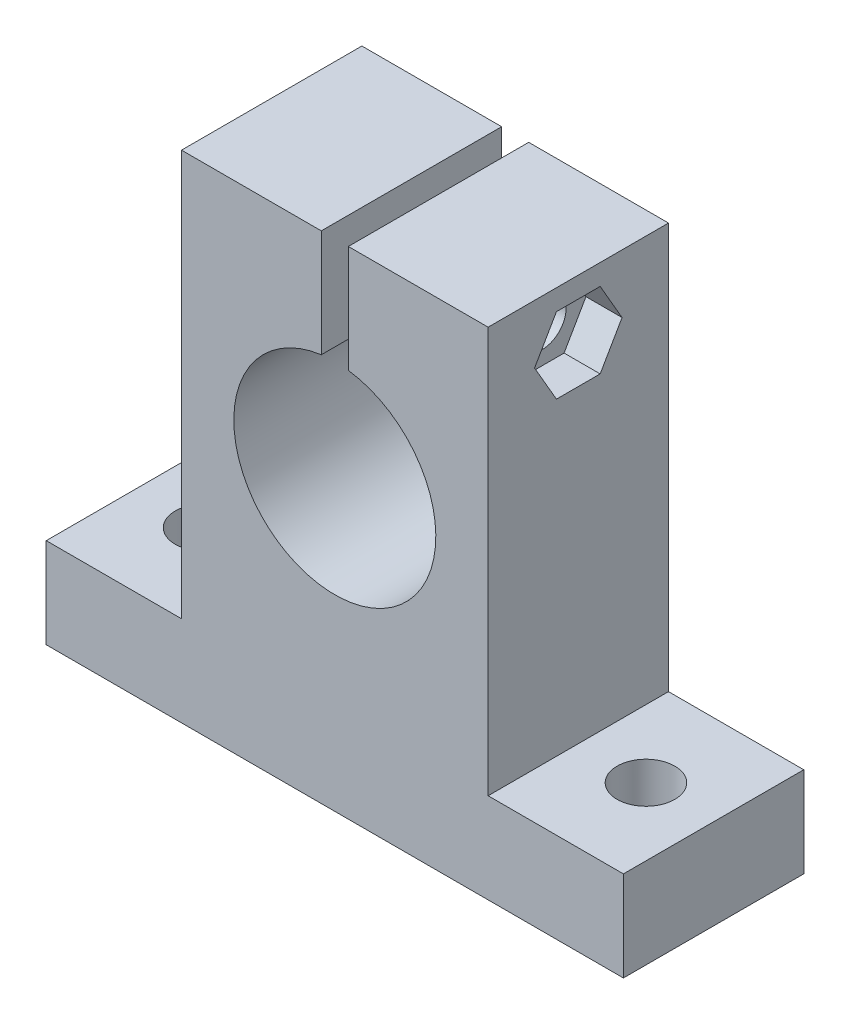
ISO-10303-21;
HEADER;
FILE_DESCRIPTION(('STEP AP214'),'2;1');
FILE_NAME('part.step','',(''),(''),'','','');
FILE_SCHEMA(('AUTOMOTIVE_DESIGN { 1 0 10303 214 1 1 1 1 }'));
ENDSEC;
DATA;
#1=APPLICATION_CONTEXT('core data for automotive mechanical design processes');
#2=APPLICATION_PROTOCOL_DEFINITION('international standard','automotive_design',2000,#1);
#3=PRODUCT_CONTEXT('',#1,'mechanical');
#4=PRODUCT('Part','Part','',(#3));
#5=PRODUCT_RELATED_PRODUCT_CATEGORY('part','',(#4));
#6=PRODUCT_DEFINITION_FORMATION('','',#4);
#7=PRODUCT_DEFINITION_CONTEXT('part definition',#1,'design');
#8=PRODUCT_DEFINITION('design','',#6,#7);
#9=PRODUCT_DEFINITION_SHAPE('','',#8);
#10=(LENGTH_UNIT() NAMED_UNIT(*) SI_UNIT(.MILLI.,.METRE.));
#11=(NAMED_UNIT(*) PLANE_ANGLE_UNIT() SI_UNIT($,.RADIAN.));
#12=(NAMED_UNIT(*) SI_UNIT($,.STERADIAN.) SOLID_ANGLE_UNIT());
#13=UNCERTAINTY_MEASURE_WITH_UNIT(LENGTH_MEASURE(1.E-05),#10,'distance_accuracy_value','');
#14=(GEOMETRIC_REPRESENTATION_CONTEXT(3) GLOBAL_UNCERTAINTY_ASSIGNED_CONTEXT((#13)) GLOBAL_UNIT_ASSIGNED_CONTEXT((#10,
#11,#12)) REPRESENTATION_CONTEXT('',''));
#15=CARTESIAN_POINT('',(0.,0.,0.));
#16=DIRECTION('',(0.,0.,1.));
#17=DIRECTION('',(1.,0.,0.));
#18=AXIS2_PLACEMENT_3D('',#15,#16,#17);
#19=CARTESIAN_POINT('',(-20.,-6.69753086419754,10.));
#20=DIRECTION('',(1.,0.,0.));
#21=DIRECTION('',(0.,0.,-1.));
#22=AXIS2_PLACEMENT_3D('',#19,#20,#21);
#23=CYLINDRICAL_SURFACE('',#22,2.65);
#24=CARTESIAN_POINT('',(1.50000000000001,-6.69753086419754,10.));
#25=DIRECTION('',(1.,0.,0.));
#26=DIRECTION('',(0.,1.,0.));
#27=AXIS2_PLACEMENT_3D('',#24,#25,#26);
#28=CIRCLE('',#27,2.65);
#29=CARTESIAN_POINT('',(1.50000000000001,-4.04753086419754,10.));
#30=VERTEX_POINT('',#29);
#31=EDGE_CURVE('E174',#30,#30,#28,.T.);
#32=ORIENTED_EDGE('',*,*,#31,.F.);
#33=EDGE_LOOP('',(#32));
#34=FACE_BOUND('',#33,.T.);
#35=CARTESIAN_POINT('',(13.,-6.69753086419754,10.));
#36=DIRECTION('',(1.,0.,0.));
#37=DIRECTION('',(0.,0.,-1.));
#38=AXIS2_PLACEMENT_3D('',#35,#36,#37);
#39=CIRCLE('',#38,2.65);
#40=CARTESIAN_POINT('',(13.,-6.69753086419754,7.35));
#41=VERTEX_POINT('',#40);
#42=EDGE_CURVE('E221',#41,#41,#39,.F.);
#43=ORIENTED_EDGE('',*,*,#42,.F.);
#44=EDGE_LOOP('',(#43));
#45=FACE_BOUND('',#44,.T.);
#46=ADVANCED_FACE('F35',(#34,#45),#23,.F.);
#47=CARTESIAN_POINT('',(17.,-0.197530864197544,20.));
#48=DIRECTION('',(-1.,0.,0.));
#49=DIRECTION('',(0.,-1.,0.));
#50=AXIS2_PLACEMENT_3D('',#47,#48,#49);
#51=PLANE('',#50);
#52=DIRECTION('',(0.,0.866025403784438,0.5));
#53=VECTOR('',#52,1.);
#54=CARTESIAN_POINT('',(17.,-6.69753086419754,5.15075642137325));
#55=LINE('',#54,#53);
#56=CARTESIAN_POINT('',(17.,-6.69753086419754,5.15075642137325));
#57=VERTEX_POINT('',#56);
#58=CARTESIAN_POINT('',(17.,-2.4979627359682,7.57537821068663));
#59=VERTEX_POINT('',#58);
#60=EDGE_CURVE('E513',#57,#59,#55,.T.);
#61=ORIENTED_EDGE('',*,*,#60,.F.);
#62=DIRECTION('',(0.,0.866025403784439,-0.499999999999999));
#63=VECTOR('',#62,1.);
#64=CARTESIAN_POINT('',(17.,-10.8970989924269,7.57537821068662));
#65=LINE('',#64,#63);
#66=CARTESIAN_POINT('',(17.,-10.8970989924269,7.57537821068662));
#67=VERTEX_POINT('',#66);
#68=EDGE_CURVE('E52',#67,#57,#65,.T.);
#69=ORIENTED_EDGE('',*,*,#68,.F.);
#70=DIRECTION('',(0.,0.,-1.));
#71=VECTOR('',#70,1.);
#72=CARTESIAN_POINT('',(17.,-10.8970989924269,12.4246217893134));
#73=LINE('',#72,#71);
#74=CARTESIAN_POINT('',(17.,-10.8970989924269,12.4246217893134));
#75=VERTEX_POINT('',#74);
#76=EDGE_CURVE('E235',#75,#67,#73,.T.);
#77=ORIENTED_EDGE('',*,*,#76,.F.);
#78=DIRECTION('',(0.,-0.866025403784438,-0.5));
#79=VECTOR('',#78,1.);
#80=CARTESIAN_POINT('',(17.,-6.69753086419754,14.8492435786268));
#81=LINE('',#80,#79);
#82=CARTESIAN_POINT('',(17.,-6.69753086419754,14.8492435786268));
#83=VERTEX_POINT('',#82);
#84=EDGE_CURVE('E544',#83,#75,#81,.T.);
#85=ORIENTED_EDGE('',*,*,#84,.F.);
#86=DIRECTION('',(0.,-0.866025403784439,0.499999999999999));
#87=VECTOR('',#86,1.);
#88=CARTESIAN_POINT('',(17.,-2.4979627359682,12.4246217893134));
#89=LINE('',#88,#87);
#90=CARTESIAN_POINT('',(17.,-2.4979627359682,12.4246217893134));
#91=VERTEX_POINT('',#90);
#92=EDGE_CURVE('E542',#91,#83,#89,.T.);
#93=ORIENTED_EDGE('',*,*,#92,.F.);
#94=DIRECTION('',(0.,0.,1.));
#95=VECTOR('',#94,1.);
#96=CARTESIAN_POINT('',(17.,-2.4979627359682,7.57537821068663));
#97=LINE('',#96,#95);
#98=EDGE_CURVE('E539',#59,#91,#97,.T.);
#99=ORIENTED_EDGE('',*,*,#98,.F.);
#100=EDGE_LOOP('',(#61,#69,#77,#85,#93,#99));
#101=FACE_BOUND('',#100,.T.);
#102=DIRECTION('',(0.,1.,0.));
#103=VECTOR('',#102,1.);
#104=CARTESIAN_POINT('',(17.,-0.197530864197544,0.));
#105=LINE('',#104,#103);
#106=CARTESIAN_POINT('',(17.,-45.1975308641975,0.));
#107=VERTEX_POINT('',#106);
#108=CARTESIAN_POINT('',(17.,-0.197530864197544,0.));
#109=VERTEX_POINT('',#108);
#110=EDGE_CURVE('E170',#107,#109,#105,.T.);
#111=ORIENTED_EDGE('',*,*,#110,.T.);
#112=DIRECTION('',(0.,0.,-1.));
#113=VECTOR('',#112,1.);
#114=CARTESIAN_POINT('',(17.,-0.197530864197544,20.));
#115=LINE('',#114,#113);
#116=CARTESIAN_POINT('',(17.,-0.197530864197544,20.));
#117=VERTEX_POINT('',#116);
#118=EDGE_CURVE('E11',#117,#109,#115,.T.);
#119=ORIENTED_EDGE('',*,*,#118,.F.);
#120=DIRECTION('',(0.,1.,0.));
#121=VECTOR('',#120,1.);
#122=CARTESIAN_POINT('',(17.,-0.197530864197544,20.));
#123=LINE('',#122,#121);
#124=CARTESIAN_POINT('',(17.,-45.1975308641975,20.));
#125=VERTEX_POINT('',#124);
#126=EDGE_CURVE('E194',#125,#117,#123,.T.);
#127=ORIENTED_EDGE('',*,*,#126,.F.);
#128=DIRECTION('',(0.,0.,-1.));
#129=VECTOR('',#128,1.);
#130=CARTESIAN_POINT('',(17.,-45.1975308641975,20.));
#131=LINE('',#130,#129);
#132=EDGE_CURVE('E166',#125,#107,#131,.T.);
#133=ORIENTED_EDGE('',*,*,#132,.T.);
#134=EDGE_LOOP('',(#111,#119,#127,#133));
#135=FACE_BOUND('',#134,.T.);
#136=ADVANCED_FACE('F37',(#101,#135),#51,.F.);
#137=CARTESIAN_POINT('',(17.,-0.197530864197544,20.));
#138=DIRECTION('',(0.,-1.,0.));
#139=DIRECTION('',(1.,0.,0.));
#140=AXIS2_PLACEMENT_3D('',#137,#138,#139);
#141=PLANE('',#140);
#142=DIRECTION('',(-1.,0.,0.));
#143=VECTOR('',#142,1.);
#144=CARTESIAN_POINT('',(17.,-0.197530864197544,0.));
#145=LINE('',#144,#143);
#146=CARTESIAN_POINT('',(1.50000000000001,-0.19753086419755,0.));
#147=VERTEX_POINT('',#146);
#148=EDGE_CURVE('E173',#109,#147,#145,.T.);
#149=ORIENTED_EDGE('',*,*,#148,.T.);
#150=DIRECTION('',(0.,0.,-1.));
#151=VECTOR('',#150,1.);
#152=CARTESIAN_POINT('',(1.50000000000001,-0.19753086419755,20.));
#153=LINE('',#152,#151);
#154=CARTESIAN_POINT('',(1.50000000000001,-0.19753086419755,20.));
#155=VERTEX_POINT('',#154);
#156=EDGE_CURVE('E44',#155,#147,#153,.T.);
#157=ORIENTED_EDGE('',*,*,#156,.F.);
#158=DIRECTION('',(-1.,0.,0.));
#159=VECTOR('',#158,1.);
#160=CARTESIAN_POINT('',(17.,-0.197530864197544,20.));
#161=LINE('',#160,#159);
#162=EDGE_CURVE('E114',#117,#155,#161,.T.);
#163=ORIENTED_EDGE('',*,*,#162,.F.);
#164=ORIENTED_EDGE('',*,*,#118,.T.);
#165=EDGE_LOOP('',(#149,#157,#163,#164));
#166=FACE_BOUND('',#165,.T.);
#167=ADVANCED_FACE('F285',(#166),#141,.F.);
#168=CARTESIAN_POINT('',(1.50000000000001,-0.19753086419755,20.));
#169=DIRECTION('',(1.,0.,0.));
#170=DIRECTION('',(0.,1.,0.));
#171=AXIS2_PLACEMENT_3D('',#168,#169,#170);
#172=PLANE('',#171);
#173=ORIENTED_EDGE('',*,*,#31,.T.);
#174=EDGE_LOOP('',(#173));
#175=FACE_BOUND('',#174,.T.);
#176=DIRECTION('',(0.,-1.,0.));
#177=VECTOR('',#176,1.);
#178=CARTESIAN_POINT('',(1.50000000000001,-0.19753086419755,0.));
#179=LINE('',#178,#177);
#180=CARTESIAN_POINT('',(1.50000000000001,-12.098431801661,0.));
#181=VERTEX_POINT('',#180);
#182=EDGE_CURVE('E176',#147,#181,#179,.T.);
#183=ORIENTED_EDGE('',*,*,#182,.T.);
#184=DIRECTION('',(0.,0.,-1.));
#185=VECTOR('',#184,1.);
#186=CARTESIAN_POINT('',(1.50000000000001,-12.098431801661,20.));
#187=LINE('',#186,#185);
#188=CARTESIAN_POINT('',(1.50000000000001,-12.098431801661,20.));
#189=VERTEX_POINT('',#188);
#190=EDGE_CURVE('E213',#189,#181,#187,.T.);
#191=ORIENTED_EDGE('',*,*,#190,.F.);
#192=DIRECTION('',(0.,-1.,0.));
#193=VECTOR('',#192,1.);
#194=CARTESIAN_POINT('',(1.50000000000001,-0.19753086419755,20.));
#195=LINE('',#194,#193);
#196=EDGE_CURVE('E255',#155,#189,#195,.T.);
#197=ORIENTED_EDGE('',*,*,#196,.F.);
#198=ORIENTED_EDGE('',*,*,#156,.T.);
#199=EDGE_LOOP('',(#183,#191,#197,#198));
#200=FACE_BOUND('',#199,.T.);
#201=ADVANCED_FACE('F288',(#175,#200),#172,.F.);
#202=CARTESIAN_POINT('',(0.,-23.1975308641975,20.));
#203=DIRECTION('',(0.,0.,-1.));
#204=DIRECTION('',(-1.,0.,0.));
#205=AXIS2_PLACEMENT_3D('',#202,#203,#204);
#206=CYLINDRICAL_SURFACE('',#205,11.2);
#207=CARTESIAN_POINT('',(0.,-23.1975308641975,0.));
#208=DIRECTION('',(0.,0.,-1.));
#209=DIRECTION('',(1.,0.,0.));
#210=AXIS2_PLACEMENT_3D('',#207,#208,#209);
#211=CIRCLE('',#210,11.2);
#212=CARTESIAN_POINT('',(-1.49999999999999,-12.098431801661,0.));
#213=VERTEX_POINT('',#212);
#214=EDGE_CURVE('E178',#181,#213,#211,.T.);
#215=ORIENTED_EDGE('',*,*,#214,.T.);
#216=DIRECTION('',(0.,0.,-1.));
#217=VECTOR('',#216,1.);
#218=CARTESIAN_POINT('',(-1.49999999999999,-12.098431801661,20.));
#219=LINE('',#218,#217);
#220=CARTESIAN_POINT('',(-1.49999999999999,-12.098431801661,20.));
#221=VERTEX_POINT('',#220);
#222=EDGE_CURVE('E210',#221,#213,#219,.T.);
#223=ORIENTED_EDGE('',*,*,#222,.F.);
#224=CARTESIAN_POINT('',(0.,-23.1975308641975,20.));
#225=DIRECTION('',(0.,0.,-1.));
#226=DIRECTION('',(1.,0.,0.));
#227=AXIS2_PLACEMENT_3D('',#224,#225,#226);
#228=CIRCLE('',#227,11.2);
#229=EDGE_CURVE('E257',#189,#221,#228,.T.);
#230=ORIENTED_EDGE('',*,*,#229,.F.);
#231=ORIENTED_EDGE('',*,*,#190,.T.);
#232=EDGE_LOOP('',(#215,#223,#230,#231));
#233=FACE_BOUND('',#232,.T.);
#234=ADVANCED_FACE('F293',(#233),#206,.F.);
#235=CARTESIAN_POINT('',(-1.49999999999999,-0.19753086419755,20.));
#236=DIRECTION('',(-1.,0.,0.));
#237=DIRECTION('',(0.,-1.,0.));
#238=AXIS2_PLACEMENT_3D('',#235,#236,#237);
#239=PLANE('',#238);
#240=CARTESIAN_POINT('',(-1.49999999999999,-6.69753086419754,10.));
#241=DIRECTION('',(-1.,0.,0.));
#242=DIRECTION('',(0.,-1.,0.));
#243=AXIS2_PLACEMENT_3D('',#240,#241,#242);
#244=CIRCLE('',#243,2.65);
#245=CARTESIAN_POINT('',(-1.49999999999999,-9.34753086419754,10.));
#246=VERTEX_POINT('',#245);
#247=EDGE_CURVE('E220',#246,#246,#244,.T.);
#248=ORIENTED_EDGE('',*,*,#247,.T.);
#249=EDGE_LOOP('',(#248));
#250=FACE_BOUND('',#249,.T.);
#251=DIRECTION('',(0.,1.,0.));
#252=VECTOR('',#251,1.);
#253=CARTESIAN_POINT('',(-1.49999999999999,-0.19753086419755,0.));
#254=LINE('',#253,#252);
#255=CARTESIAN_POINT('',(-1.49999999999999,-0.19753086419755,0.));
#256=VERTEX_POINT('',#255);
#257=EDGE_CURVE('E180',#213,#256,#254,.T.);
#258=ORIENTED_EDGE('',*,*,#257,.T.);
#259=DIRECTION('',(0.,0.,-1.));
#260=VECTOR('',#259,1.);
#261=CARTESIAN_POINT('',(-1.49999999999999,-0.19753086419755,20.));
#262=LINE('',#261,#260);
#263=CARTESIAN_POINT('',(-1.49999999999999,-0.19753086419755,20.));
#264=VERTEX_POINT('',#263);
#265=EDGE_CURVE('E207',#264,#256,#262,.T.);
#266=ORIENTED_EDGE('',*,*,#265,.F.);
#267=DIRECTION('',(0.,1.,0.));
#268=VECTOR('',#267,1.);
#269=CARTESIAN_POINT('',(-1.49999999999999,-0.19753086419755,20.));
#270=LINE('',#269,#268);
#271=EDGE_CURVE('E259',#221,#264,#270,.T.);
#272=ORIENTED_EDGE('',*,*,#271,.F.);
#273=ORIENTED_EDGE('',*,*,#222,.T.);
#274=EDGE_LOOP('',(#258,#266,#272,#273));
#275=FACE_BOUND('',#274,.T.);
#276=ADVANCED_FACE('F299',(#250,#275),#239,.F.);
#277=CARTESIAN_POINT('',(-1.49999999999999,-0.19753086419755,20.));
#278=DIRECTION('',(0.,-1.,0.));
#279=DIRECTION('',(1.,0.,0.));
#280=AXIS2_PLACEMENT_3D('',#277,#278,#279);
#281=PLANE('',#280);
#282=DIRECTION('',(-1.,0.,0.));
#283=VECTOR('',#282,1.);
#284=CARTESIAN_POINT('',(-1.49999999999999,-0.19753086419755,0.));
#285=LINE('',#284,#283);
#286=CARTESIAN_POINT('',(-17.,-0.197530864197548,0.));
#287=VERTEX_POINT('',#286);
#288=EDGE_CURVE('E182',#256,#287,#285,.T.);
#289=ORIENTED_EDGE('',*,*,#288,.T.);
#290=DIRECTION('',(0.,0.,-1.));
#291=VECTOR('',#290,1.);
#292=CARTESIAN_POINT('',(-17.,-0.197530864197548,20.));
#293=LINE('',#292,#291);
#294=CARTESIAN_POINT('',(-17.,-0.197530864197548,20.));
#295=VERTEX_POINT('',#294);
#296=EDGE_CURVE('E204',#295,#287,#293,.T.);
#297=ORIENTED_EDGE('',*,*,#296,.F.);
#298=DIRECTION('',(-1.,0.,0.));
#299=VECTOR('',#298,1.);
#300=CARTESIAN_POINT('',(-1.49999999999999,-0.19753086419755,20.));
#301=LINE('',#300,#299);
#302=EDGE_CURVE('E261',#264,#295,#301,.T.);
#303=ORIENTED_EDGE('',*,*,#302,.F.);
#304=ORIENTED_EDGE('',*,*,#265,.T.);
#305=EDGE_LOOP('',(#289,#297,#303,#304));
#306=FACE_BOUND('',#305,.T.);
#307=ADVANCED_FACE('F303',(#306),#281,.F.);
#308=CARTESIAN_POINT('',(-17.,-0.197530864197548,20.));
#309=DIRECTION('',(1.,0.,0.));
#310=DIRECTION('',(0.,1.,0.));
#311=AXIS2_PLACEMENT_3D('',#308,#309,#310);
#312=PLANE('',#311);
#313=CARTESIAN_POINT('',(-17.,-6.69753086419754,10.));
#314=DIRECTION('',(1.,0.,0.));
#315=DIRECTION('',(0.,1.,0.));
#316=AXIS2_PLACEMENT_3D('',#313,#314,#315);
#317=CIRCLE('',#316,2.65);
#318=CARTESIAN_POINT('',(-17.,-4.04753086419754,10.));
#319=VERTEX_POINT('',#318);
#320=EDGE_CURVE('E218',#319,#319,#317,.T.);
#321=ORIENTED_EDGE('',*,*,#320,.T.);
#322=EDGE_LOOP('',(#321));
#323=FACE_BOUND('',#322,.T.);
#324=DIRECTION('',(0.,-1.,0.));
#325=VECTOR('',#324,1.);
#326=CARTESIAN_POINT('',(-17.,-0.197530864197548,0.));
#327=LINE('',#326,#325);
#328=CARTESIAN_POINT('',(-17.,-45.1975308641975,0.));
#329=VERTEX_POINT('',#328);
#330=EDGE_CURVE('E184',#287,#329,#327,.T.);
#331=ORIENTED_EDGE('',*,*,#330,.T.);
#332=DIRECTION('',(0.,0.,-1.));
#333=VECTOR('',#332,1.);
#334=CARTESIAN_POINT('',(-17.,-45.1975308641975,20.));
#335=LINE('',#334,#333);
#336=CARTESIAN_POINT('',(-17.,-45.1975308641975,20.));
#337=VERTEX_POINT('',#336);
#338=EDGE_CURVE('E201',#337,#329,#335,.T.);
#339=ORIENTED_EDGE('',*,*,#338,.F.);
#340=DIRECTION('',(0.,-1.,0.));
#341=VECTOR('',#340,1.);
#342=CARTESIAN_POINT('',(-17.,-0.197530864197548,20.));
#343=LINE('',#342,#341);
#344=EDGE_CURVE('E263',#295,#337,#343,.T.);
#345=ORIENTED_EDGE('',*,*,#344,.F.);
#346=ORIENTED_EDGE('',*,*,#296,.T.);
#347=EDGE_LOOP('',(#331,#339,#345,#346));
#348=FACE_BOUND('',#347,.T.);
#349=ADVANCED_FACE('F306',(#323,#348),#312,.F.);
#350=CARTESIAN_POINT('',(-32.,-45.1975308641975,20.));
#351=DIRECTION('',(0.,-1.,0.));
#352=DIRECTION('',(0.,0.,-1.));
#353=AXIS2_PLACEMENT_3D('',#350,#351,#352);
#354=PLANE('',#353);
#355=CARTESIAN_POINT('',(-24.5,-45.1975308641975,10.));
#356=DIRECTION('',(0.,-1.,0.));
#357=DIRECTION('',(0.,0.,-1.));
#358=AXIS2_PLACEMENT_3D('',#355,#356,#357);
#359=CIRCLE('',#358,3.2);
#360=CARTESIAN_POINT('',(-24.5,-45.1975308641975,6.8));
#361=VERTEX_POINT('',#360);
#362=EDGE_CURVE('E511',#361,#361,#359,.T.);
#363=ORIENTED_EDGE('',*,*,#362,.T.);
#364=EDGE_LOOP('',(#363));
#365=FACE_BOUND('',#364,.T.);
#366=DIRECTION('',(-1.,0.,0.));
#367=VECTOR('',#366,1.);
#368=CARTESIAN_POINT('',(-32.,-45.1975308641975,0.));
#369=LINE('',#368,#367);
#370=CARTESIAN_POINT('',(-32.,-45.1975308641975,0.));
#371=VERTEX_POINT('',#370);
#372=EDGE_CURVE('E186',#329,#371,#369,.T.);
#373=ORIENTED_EDGE('',*,*,#372,.T.);
#374=DIRECTION('',(0.,0.,-1.));
#375=VECTOR('',#374,1.);
#376=CARTESIAN_POINT('',(-32.,-45.1975308641975,20.));
#377=LINE('',#376,#375);
#378=CARTESIAN_POINT('',(-32.,-45.1975308641975,20.));
#379=VERTEX_POINT('',#378);
#380=EDGE_CURVE('E198',#379,#371,#377,.T.);
#381=ORIENTED_EDGE('',*,*,#380,.F.);
#382=DIRECTION('',(-1.,0.,0.));
#383=VECTOR('',#382,1.);
#384=CARTESIAN_POINT('',(-32.,-45.1975308641975,20.));
#385=LINE('',#384,#383);
#386=EDGE_CURVE('E265',#337,#379,#385,.T.);
#387=ORIENTED_EDGE('',*,*,#386,.F.);
#388=ORIENTED_EDGE('',*,*,#338,.T.);
#389=EDGE_LOOP('',(#373,#381,#387,#388));
#390=FACE_BOUND('',#389,.T.);
#391=ADVANCED_FACE('F271',(#365,#390),#354,.F.);
#392=CARTESIAN_POINT('',(-32.,-55.1975308641975,20.));
#393=DIRECTION('',(1.,0.,0.));
#394=DIRECTION('',(0.,0.,-1.));
#395=AXIS2_PLACEMENT_3D('',#392,#393,#394);
#396=PLANE('',#395);
#397=DIRECTION('',(0.,-1.,0.));
#398=VECTOR('',#397,1.);
#399=CARTESIAN_POINT('',(-32.,-55.1975308641975,0.));
#400=LINE('',#399,#398);
#401=CARTESIAN_POINT('',(-32.,-55.1975308641975,0.));
#402=VERTEX_POINT('',#401);
#403=EDGE_CURVE('E188',#371,#402,#400,.T.);
#404=ORIENTED_EDGE('',*,*,#403,.T.);
#405=DIRECTION('',(0.,0.,-1.));
#406=VECTOR('',#405,1.);
#407=CARTESIAN_POINT('',(-32.,-55.1975308641975,20.));
#408=LINE('',#407,#406);
#409=CARTESIAN_POINT('',(-32.,-55.1975308641975,20.));
#410=VERTEX_POINT('',#409);
#411=EDGE_CURVE('E161',#410,#402,#408,.T.);
#412=ORIENTED_EDGE('',*,*,#411,.F.);
#413=DIRECTION('',(0.,-1.,0.));
#414=VECTOR('',#413,1.);
#415=CARTESIAN_POINT('',(-32.,-55.1975308641975,20.));
#416=LINE('',#415,#414);
#417=EDGE_CURVE('E149',#379,#410,#416,.T.);
#418=ORIENTED_EDGE('',*,*,#417,.F.);
#419=ORIENTED_EDGE('',*,*,#380,.T.);
#420=EDGE_LOOP('',(#404,#412,#418,#419));
#421=FACE_BOUND('',#420,.T.);
#422=ADVANCED_FACE('F275',(#421),#396,.F.);
#423=CARTESIAN_POINT('',(-32.,-55.1975308641975,20.));
#424=DIRECTION('',(0.,1.,0.));
#425=DIRECTION('',(-1.,0.,0.));
#426=AXIS2_PLACEMENT_3D('',#423,#424,#425);
#427=PLANE('',#426);
#428=CARTESIAN_POINT('',(-24.5,-55.1975308641975,10.));
#429=DIRECTION('',(0.,-1.,0.));
#430=DIRECTION('',(1.,0.,0.));
#431=AXIS2_PLACEMENT_3D('',#428,#429,#430);
#432=CIRCLE('',#431,3.2);
#433=CARTESIAN_POINT('',(-21.3,-55.1975308641975,10.));
#434=VERTEX_POINT('',#433);
#435=EDGE_CURVE('E508',#434,#434,#432,.T.);
#436=ORIENTED_EDGE('',*,*,#435,.F.);
#437=EDGE_LOOP('',(#436));
#438=FACE_BOUND('',#437,.T.);
#439=CARTESIAN_POINT('',(24.5,-55.1975308641975,10.));
#440=DIRECTION('',(0.,-1.,0.));
#441=DIRECTION('',(-1.,0.,0.));
#442=AXIS2_PLACEMENT_3D('',#439,#440,#441);
#443=CIRCLE('',#442,3.2);
#444=CARTESIAN_POINT('',(21.3,-55.1975308641975,10.));
#445=VERTEX_POINT('',#444);
#446=EDGE_CURVE('E518',#445,#445,#443,.T.);
#447=ORIENTED_EDGE('',*,*,#446,.F.);
#448=EDGE_LOOP('',(#447));
#449=FACE_BOUND('',#448,.T.);
#450=DIRECTION('',(1.,0.,0.));
#451=VECTOR('',#450,1.);
#452=CARTESIAN_POINT('',(-32.,-55.1975308641975,0.));
#453=LINE('',#452,#451);
#454=CARTESIAN_POINT('',(32.,-55.1975308641975,0.));
#455=VERTEX_POINT('',#454);
#456=EDGE_CURVE('E158',#402,#455,#453,.T.);
#457=ORIENTED_EDGE('',*,*,#456,.T.);
#458=DIRECTION('',(0.,0.,-1.));
#459=VECTOR('',#458,1.);
#460=CARTESIAN_POINT('',(32.,-55.1975308641975,20.));
#461=LINE('',#460,#459);
#462=CARTESIAN_POINT('',(32.,-55.1975308641975,20.));
#463=VERTEX_POINT('',#462);
#464=EDGE_CURVE('E155',#463,#455,#461,.T.);
#465=ORIENTED_EDGE('',*,*,#464,.F.);
#466=DIRECTION('',(1.,0.,0.));
#467=VECTOR('',#466,1.);
#468=CARTESIAN_POINT('',(-32.,-55.1975308641975,20.));
#469=LINE('',#468,#467);
#470=EDGE_CURVE('E142',#410,#463,#469,.T.);
#471=ORIENTED_EDGE('',*,*,#470,.F.);
#472=ORIENTED_EDGE('',*,*,#411,.T.);
#473=EDGE_LOOP('',(#457,#465,#471,#472));
#474=FACE_BOUND('',#473,.T.);
#475=ADVANCED_FACE('F156',(#438,#449,#474),#427,.F.);
#476=CARTESIAN_POINT('',(32.,-55.1975308641975,20.));
#477=DIRECTION('',(-1.,0.,0.));
#478=DIRECTION('',(0.,0.,1.));
#479=AXIS2_PLACEMENT_3D('',#476,#477,#478);
#480=PLANE('',#479);
#481=DIRECTION('',(0.,1.,0.));
#482=VECTOR('',#481,1.);
#483=CARTESIAN_POINT('',(32.,-55.1975308641975,0.));
#484=LINE('',#483,#482);
#485=CARTESIAN_POINT('',(32.,-45.1975308641975,0.));
#486=VERTEX_POINT('',#485);
#487=EDGE_CURVE('E191',#455,#486,#484,.T.);
#488=ORIENTED_EDGE('',*,*,#487,.T.);
#489=DIRECTION('',(0.,0.,-1.));
#490=VECTOR('',#489,1.);
#491=CARTESIAN_POINT('',(32.,-45.1975308641975,20.));
#492=LINE('',#491,#490);
#493=CARTESIAN_POINT('',(32.,-45.1975308641975,20.));
#494=VERTEX_POINT('',#493);
#495=EDGE_CURVE('E162',#494,#486,#492,.T.);
#496=ORIENTED_EDGE('',*,*,#495,.F.);
#497=DIRECTION('',(0.,1.,0.));
#498=VECTOR('',#497,1.);
#499=CARTESIAN_POINT('',(32.,-55.1975308641975,20.));
#500=LINE('',#499,#498);
#501=EDGE_CURVE('E146',#463,#494,#500,.T.);
#502=ORIENTED_EDGE('',*,*,#501,.F.);
#503=ORIENTED_EDGE('',*,*,#464,.T.);
#504=EDGE_LOOP('',(#488,#496,#502,#503));
#505=FACE_BOUND('',#504,.T.);
#506=ADVANCED_FACE('F164',(#505),#480,.F.);
#507=CARTESIAN_POINT('',(17.,-45.1975308641975,20.));
#508=DIRECTION('',(0.,-1.,0.));
#509=DIRECTION('',(0.,0.,-1.));
#510=AXIS2_PLACEMENT_3D('',#507,#508,#509);
#511=PLANE('',#510);
#512=CARTESIAN_POINT('',(24.5,-45.1975308641975,10.));
#513=DIRECTION('',(0.,-1.,0.));
#514=DIRECTION('',(0.,0.,-1.));
#515=AXIS2_PLACEMENT_3D('',#512,#513,#514);
#516=CIRCLE('',#515,3.2);
#517=CARTESIAN_POINT('',(24.5,-45.1975308641975,6.8));
#518=VERTEX_POINT('',#517);
#519=EDGE_CURVE('E39',#518,#518,#516,.T.);
#520=ORIENTED_EDGE('',*,*,#519,.T.);
#521=EDGE_LOOP('',(#520));
#522=FACE_BOUND('',#521,.T.);
#523=DIRECTION('',(-1.,0.,0.));
#524=VECTOR('',#523,1.);
#525=CARTESIAN_POINT('',(17.,-45.1975308641975,0.));
#526=LINE('',#525,#524);
#527=EDGE_CURVE('E106',#486,#107,#526,.T.);
#528=ORIENTED_EDGE('',*,*,#527,.T.);
#529=ORIENTED_EDGE('',*,*,#132,.F.);
#530=DIRECTION('',(-1.,0.,0.));
#531=VECTOR('',#530,1.);
#532=CARTESIAN_POINT('',(17.,-45.1975308641975,20.));
#533=LINE('',#532,#531);
#534=EDGE_CURVE('E61',#494,#125,#533,.T.);
#535=ORIENTED_EDGE('',*,*,#534,.F.);
#536=ORIENTED_EDGE('',*,*,#495,.T.);
#537=EDGE_LOOP('',(#528,#529,#535,#536));
#538=FACE_BOUND('',#537,.T.);
#539=ADVANCED_FACE('F279',(#522,#538),#511,.F.);
#540=CARTESIAN_POINT('',(0.,-23.1975308641975,20.));
#541=DIRECTION('',(0.,0.,1.));
#542=DIRECTION('',(1.,0.,0.));
#543=AXIS2_PLACEMENT_3D('',#540,#541,#542);
#544=PLANE('',#543);
#545=ORIENTED_EDGE('',*,*,#126,.T.);
#546=ORIENTED_EDGE('',*,*,#162,.T.);
#547=ORIENTED_EDGE('',*,*,#196,.T.);
#548=ORIENTED_EDGE('',*,*,#229,.T.);
#549=ORIENTED_EDGE('',*,*,#271,.T.);
#550=ORIENTED_EDGE('',*,*,#302,.T.);
#551=ORIENTED_EDGE('',*,*,#344,.T.);
#552=ORIENTED_EDGE('',*,*,#386,.T.);
#553=ORIENTED_EDGE('',*,*,#417,.T.);
#554=ORIENTED_EDGE('',*,*,#470,.T.);
#555=ORIENTED_EDGE('',*,*,#501,.T.);
#556=ORIENTED_EDGE('',*,*,#534,.T.);
#557=EDGE_LOOP('',(#545,#546,#547,#548,#549,#550,#551,#552,#553,#554,#555,#556));
#558=FACE_BOUND('',#557,.T.);
#559=ADVANCED_FACE('F144',(#558),#544,.T.);
#560=CARTESIAN_POINT('',(0.,-23.1975308641975,0.));
#561=DIRECTION('',(0.,0.,1.));
#562=DIRECTION('',(1.,0.,0.));
#563=AXIS2_PLACEMENT_3D('',#560,#561,#562);
#564=PLANE('',#563);
#565=ORIENTED_EDGE('',*,*,#110,.F.);
#566=ORIENTED_EDGE('',*,*,#527,.F.);
#567=ORIENTED_EDGE('',*,*,#487,.F.);
#568=ORIENTED_EDGE('',*,*,#456,.F.);
#569=ORIENTED_EDGE('',*,*,#403,.F.);
#570=ORIENTED_EDGE('',*,*,#372,.F.);
#571=ORIENTED_EDGE('',*,*,#330,.F.);
#572=ORIENTED_EDGE('',*,*,#288,.F.);
#573=ORIENTED_EDGE('',*,*,#257,.F.);
#574=ORIENTED_EDGE('',*,*,#214,.F.);
#575=ORIENTED_EDGE('',*,*,#182,.F.);
#576=ORIENTED_EDGE('',*,*,#148,.F.);
#577=EDGE_LOOP('',(#565,#566,#567,#568,#569,#570,#571,#572,#573,#574,#575,#576));
#578=FACE_BOUND('',#577,.T.);
#579=ADVANCED_FACE('F278',(#578),#564,.F.);
#580=ORIENTED_EDGE('',*,*,#320,.F.);
#581=EDGE_LOOP('',(#580));
#582=FACE_BOUND('',#581,.T.);
#583=ORIENTED_EDGE('',*,*,#247,.F.);
#584=EDGE_LOOP('',(#583));
#585=FACE_BOUND('',#584,.T.);
#586=ADVANCED_FACE('F320',(#582,#585),#23,.F.);
#587=CARTESIAN_POINT('',(13.,0.,0.));
#588=DIRECTION('',(1.,0.,0.));
#589=DIRECTION('',(0.,0.,-1.));
#590=AXIS2_PLACEMENT_3D('',#587,#588,#589);
#591=PLANE('',#590);
#592=DIRECTION('',(0.,0.866025403784439,-0.499999999999999));
#593=VECTOR('',#592,1.);
#594=CARTESIAN_POINT('',(13.,-10.8970989924269,7.57537821068662));
#595=LINE('',#594,#593);
#596=CARTESIAN_POINT('',(13.,-10.8970989924269,7.57537821068662));
#597=VERTEX_POINT('',#596);
#598=CARTESIAN_POINT('',(13.,-6.69753086419754,5.15075642137325));
#599=VERTEX_POINT('',#598);
#600=EDGE_CURVE('E520',#597,#599,#595,.T.);
#601=ORIENTED_EDGE('',*,*,#600,.T.);
#602=DIRECTION('',(0.,0.866025403784438,0.5));
#603=VECTOR('',#602,1.);
#604=CARTESIAN_POINT('',(13.,-6.69753086419754,5.15075642137325));
#605=LINE('',#604,#603);
#606=CARTESIAN_POINT('',(13.,-2.4979627359682,7.57537821068663));
#607=VERTEX_POINT('',#606);
#608=EDGE_CURVE('E523',#599,#607,#605,.T.);
#609=ORIENTED_EDGE('',*,*,#608,.T.);
#610=DIRECTION('',(0.,0.,1.));
#611=VECTOR('',#610,1.);
#612=CARTESIAN_POINT('',(13.,-2.4979627359682,7.57537821068663));
#613=LINE('',#612,#611);
#614=CARTESIAN_POINT('',(13.,-2.4979627359682,12.4246217893134));
#615=VERTEX_POINT('',#614);
#616=EDGE_CURVE('E526',#607,#615,#613,.T.);
#617=ORIENTED_EDGE('',*,*,#616,.T.);
#618=DIRECTION('',(0.,-0.866025403784439,0.499999999999999));
#619=VECTOR('',#618,1.);
#620=CARTESIAN_POINT('',(13.,-2.4979627359682,12.4246217893134));
#621=LINE('',#620,#619);
#622=CARTESIAN_POINT('',(13.,-6.69753086419755,14.8492435786268));
#623=VERTEX_POINT('',#622);
#624=EDGE_CURVE('E529',#615,#623,#621,.T.);
#625=ORIENTED_EDGE('',*,*,#624,.T.);
#626=DIRECTION('',(0.,-0.866025403784438,-0.5));
#627=VECTOR('',#626,1.);
#628=CARTESIAN_POINT('',(13.,-6.69753086419755,14.8492435786268));
#629=LINE('',#628,#627);
#630=CARTESIAN_POINT('',(13.,-10.8970989924269,12.4246217893134));
#631=VERTEX_POINT('',#630);
#632=EDGE_CURVE('E532',#623,#631,#629,.T.);
#633=ORIENTED_EDGE('',*,*,#632,.T.);
#634=DIRECTION('',(0.,0.,-1.));
#635=VECTOR('',#634,1.);
#636=CARTESIAN_POINT('',(13.,-10.8970989924269,12.4246217893134));
#637=LINE('',#636,#635);
#638=EDGE_CURVE('E248',#631,#597,#637,.T.);
#639=ORIENTED_EDGE('',*,*,#638,.T.);
#640=EDGE_LOOP('',(#601,#609,#617,#625,#633,#639));
#641=FACE_BOUND('',#640,.T.);
#642=ORIENTED_EDGE('',*,*,#42,.T.);
#643=EDGE_LOOP('',(#642));
#644=FACE_BOUND('',#643,.T.);
#645=ADVANCED_FACE('F330',(#641,#644),#591,.T.);
#646=CARTESIAN_POINT('',(13.,-10.8970989924269,7.57537821068662));
#647=DIRECTION('',(0.,-0.499999999999999,-0.866025403784439));
#648=DIRECTION('',(0.,0.866025403784439,-0.499999999999999));
#649=AXIS2_PLACEMENT_3D('',#646,#647,#648);
#650=PLANE('',#649);
#651=ORIENTED_EDGE('',*,*,#68,.T.);
#652=DIRECTION('',(1.,0.,0.));
#653=VECTOR('',#652,1.);
#654=CARTESIAN_POINT('',(13.,-6.69753086419754,5.15075642137325));
#655=LINE('',#654,#653);
#656=EDGE_CURVE('E246',#599,#57,#655,.T.);
#657=ORIENTED_EDGE('',*,*,#656,.F.);
#658=ORIENTED_EDGE('',*,*,#600,.F.);
#659=DIRECTION('',(1.,0.,0.));
#660=VECTOR('',#659,1.);
#661=CARTESIAN_POINT('',(13.,-10.8970989924269,7.57537821068662));
#662=LINE('',#661,#660);
#663=EDGE_CURVE('E223',#597,#67,#662,.T.);
#664=ORIENTED_EDGE('',*,*,#663,.T.);
#665=EDGE_LOOP('',(#651,#657,#658,#664));
#666=FACE_BOUND('',#665,.T.);
#667=ADVANCED_FACE('F336',(#666),#650,.F.);
#668=CARTESIAN_POINT('',(13.,-10.8970989924269,12.4246217893134));
#669=DIRECTION('',(0.,-1.,0.));
#670=DIRECTION('',(0.,0.,-1.));
#671=AXIS2_PLACEMENT_3D('',#668,#669,#670);
#672=PLANE('',#671);
#673=ORIENTED_EDGE('',*,*,#76,.T.);
#674=ORIENTED_EDGE('',*,*,#663,.F.);
#675=ORIENTED_EDGE('',*,*,#638,.F.);
#676=DIRECTION('',(1.,0.,0.));
#677=VECTOR('',#676,1.);
#678=CARTESIAN_POINT('',(13.,-10.8970989924269,12.4246217893134));
#679=LINE('',#678,#677);
#680=EDGE_CURVE('E226',#631,#75,#679,.T.);
#681=ORIENTED_EDGE('',*,*,#680,.T.);
#682=EDGE_LOOP('',(#673,#674,#675,#681));
#683=FACE_BOUND('',#682,.T.);
#684=ADVANCED_FACE('F431',(#683),#672,.F.);
#685=CARTESIAN_POINT('',(13.,-6.69753086419755,14.8492435786268));
#686=DIRECTION('',(0.,-0.5,0.866025403784438));
#687=DIRECTION('',(0.,-0.866025403784438,-0.5));
#688=AXIS2_PLACEMENT_3D('',#685,#686,#687);
#689=PLANE('',#688);
#690=ORIENTED_EDGE('',*,*,#84,.T.);
#691=ORIENTED_EDGE('',*,*,#680,.F.);
#692=ORIENTED_EDGE('',*,*,#632,.F.);
#693=DIRECTION('',(1.,0.,0.));
#694=VECTOR('',#693,1.);
#695=CARTESIAN_POINT('',(13.,-6.69753086419755,14.8492435786268));
#696=LINE('',#695,#694);
#697=EDGE_CURVE('E232',#623,#83,#696,.T.);
#698=ORIENTED_EDGE('',*,*,#697,.T.);
#699=EDGE_LOOP('',(#690,#691,#692,#698));
#700=FACE_BOUND('',#699,.T.);
#701=ADVANCED_FACE('F438',(#700),#689,.F.);
#702=CARTESIAN_POINT('',(13.,-2.4979627359682,12.4246217893134));
#703=DIRECTION('',(0.,0.5,0.866025403784439));
#704=DIRECTION('',(0.,-0.866025403784439,0.499999999999999));
#705=AXIS2_PLACEMENT_3D('',#702,#703,#704);
#706=PLANE('',#705);
#707=ORIENTED_EDGE('',*,*,#92,.T.);
#708=ORIENTED_EDGE('',*,*,#697,.F.);
#709=ORIENTED_EDGE('',*,*,#624,.F.);
#710=DIRECTION('',(1.,0.,0.));
#711=VECTOR('',#710,1.);
#712=CARTESIAN_POINT('',(13.,-2.4979627359682,12.4246217893134));
#713=LINE('',#712,#711);
#714=EDGE_CURVE('E240',#615,#91,#713,.T.);
#715=ORIENTED_EDGE('',*,*,#714,.T.);
#716=EDGE_LOOP('',(#707,#708,#709,#715));
#717=FACE_BOUND('',#716,.T.);
#718=ADVANCED_FACE('F447',(#717),#706,.F.);
#719=CARTESIAN_POINT('',(13.,-2.4979627359682,7.57537821068663));
#720=DIRECTION('',(0.,1.,0.));
#721=DIRECTION('',(-1.,0.,0.));
#722=AXIS2_PLACEMENT_3D('',#719,#720,#721);
#723=PLANE('',#722);
#724=ORIENTED_EDGE('',*,*,#98,.T.);
#725=ORIENTED_EDGE('',*,*,#714,.F.);
#726=ORIENTED_EDGE('',*,*,#616,.F.);
#727=DIRECTION('',(1.,0.,0.));
#728=VECTOR('',#727,1.);
#729=CARTESIAN_POINT('',(13.,-2.4979627359682,7.57537821068663));
#730=LINE('',#729,#728);
#731=EDGE_CURVE('E243',#607,#59,#730,.T.);
#732=ORIENTED_EDGE('',*,*,#731,.T.);
#733=EDGE_LOOP('',(#724,#725,#726,#732));
#734=FACE_BOUND('',#733,.T.);
#735=ADVANCED_FACE('F456',(#734),#723,.F.);
#736=CARTESIAN_POINT('',(13.,-6.69753086419754,5.15075642137325));
#737=DIRECTION('',(0.,0.5,-0.866025403784439));
#738=DIRECTION('',(0.,0.866025403784438,0.5));
#739=AXIS2_PLACEMENT_3D('',#736,#737,#738);
#740=PLANE('',#739);
#741=ORIENTED_EDGE('',*,*,#60,.T.);
#742=ORIENTED_EDGE('',*,*,#731,.F.);
#743=ORIENTED_EDGE('',*,*,#608,.F.);
#744=ORIENTED_EDGE('',*,*,#656,.T.);
#745=EDGE_LOOP('',(#741,#742,#743,#744));
#746=FACE_BOUND('',#745,.T.);
#747=ADVANCED_FACE('F465',(#746),#740,.F.);
#748=CARTESIAN_POINT('',(24.5,-0.197530864197541,10.));
#749=DIRECTION('',(0.,-1.,0.));
#750=DIRECTION('',(1.,0.,0.));
#751=AXIS2_PLACEMENT_3D('',#748,#749,#750);
#752=CYLINDRICAL_SURFACE('',#751,3.2);
#753=ORIENTED_EDGE('',*,*,#446,.T.);
#754=EDGE_LOOP('',(#753));
#755=FACE_BOUND('',#754,.T.);
#756=ORIENTED_EDGE('',*,*,#519,.F.);
#757=EDGE_LOOP('',(#756));
#758=FACE_BOUND('',#757,.T.);
#759=ADVANCED_FACE('F474',(#755,#758),#752,.F.);
#760=CARTESIAN_POINT('',(-24.5,-0.197530864197541,10.));
#761=DIRECTION('',(0.,-1.,0.));
#762=DIRECTION('',(1.,0.,0.));
#763=AXIS2_PLACEMENT_3D('',#760,#761,#762);
#764=CYLINDRICAL_SURFACE('',#763,3.2);
#765=ORIENTED_EDGE('',*,*,#435,.T.);
#766=EDGE_LOOP('',(#765));
#767=FACE_BOUND('',#766,.T.);
#768=ORIENTED_EDGE('',*,*,#362,.F.);
#769=EDGE_LOOP('',(#768));
#770=FACE_BOUND('',#769,.T.);
#771=ADVANCED_FACE('F484',(#767,#770),#764,.F.);
#772=CLOSED_SHELL('',(#46,#136,#167,#201,#234,#276,#307,#349,#391,#422,#475,#506,#539,#559,#579,
#586,#645,#667,#684,#701,#718,#735,#747,#759,#771));
#773=MANIFOLD_SOLID_BREP('B2',#772);
#774=ADVANCED_BREP_SHAPE_REPRESENTATION('',(#18,#773),#14);
#775=SHAPE_DEFINITION_REPRESENTATION(#9,#774);
ENDSEC;
END-ISO-10303-21;
